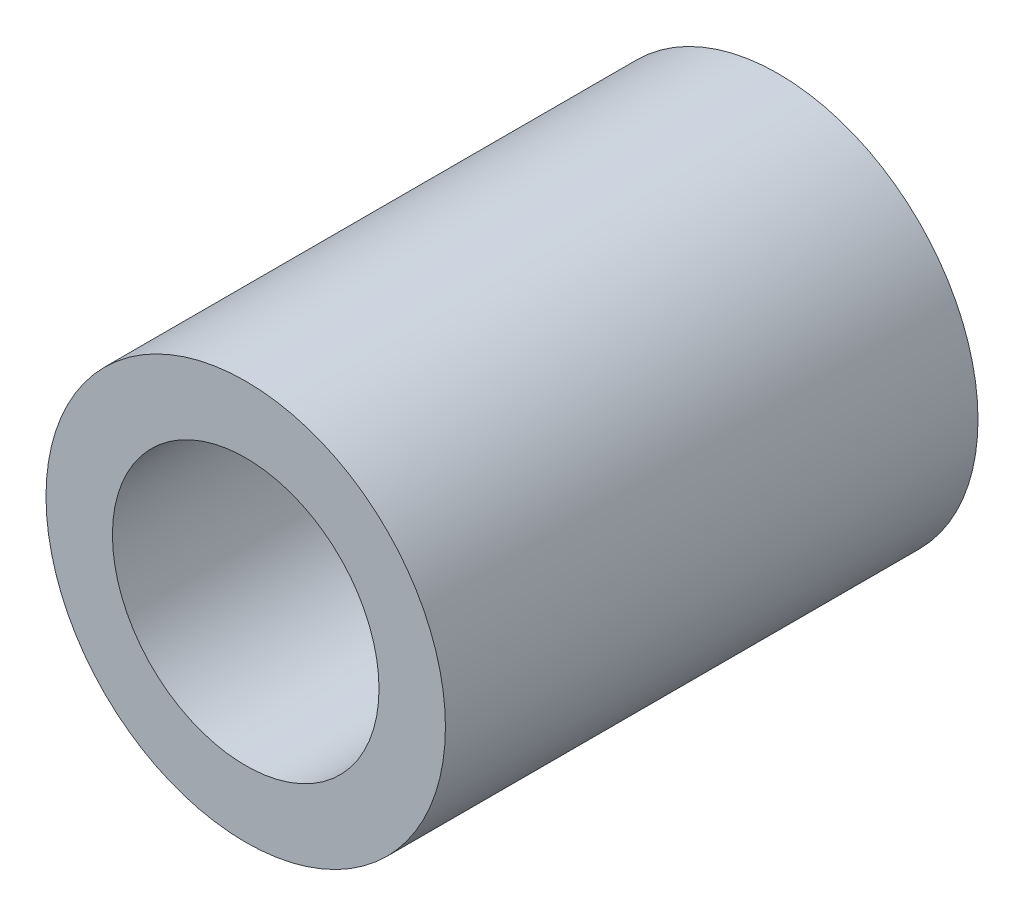
ISO-10303-21;
HEADER;
FILE_DESCRIPTION(('STEP AP214'),'2;1');
FILE_NAME('part.step','',(''),(''),'','','');
FILE_SCHEMA(('AUTOMOTIVE_DESIGN { 1 0 10303 214 1 1 1 1 }'));
ENDSEC;
DATA;
#1=APPLICATION_CONTEXT('core data for automotive mechanical design processes');
#2=APPLICATION_PROTOCOL_DEFINITION('international standard','automotive_design',2000,#1);
#3=PRODUCT_CONTEXT('',#1,'mechanical');
#4=PRODUCT('Part','Part','',(#3));
#5=PRODUCT_RELATED_PRODUCT_CATEGORY('part','',(#4));
#6=PRODUCT_DEFINITION_FORMATION('','',#4);
#7=PRODUCT_DEFINITION_CONTEXT('part definition',#1,'design');
#8=PRODUCT_DEFINITION('design','',#6,#7);
#9=PRODUCT_DEFINITION_SHAPE('','',#8);
#10=(LENGTH_UNIT() NAMED_UNIT(*) SI_UNIT(.MILLI.,.METRE.));
#11=(NAMED_UNIT(*) PLANE_ANGLE_UNIT() SI_UNIT($,.RADIAN.));
#12=(NAMED_UNIT(*) SI_UNIT($,.STERADIAN.) SOLID_ANGLE_UNIT());
#13=UNCERTAINTY_MEASURE_WITH_UNIT(LENGTH_MEASURE(1.E-05),#10,'distance_accuracy_value','');
#14=(GEOMETRIC_REPRESENTATION_CONTEXT(3) GLOBAL_UNCERTAINTY_ASSIGNED_CONTEXT((#13)) GLOBAL_UNIT_ASSIGNED_CONTEXT((#10,
#11,#12)) REPRESENTATION_CONTEXT('',''));
#15=CARTESIAN_POINT('',(0.,0.,0.));
#16=DIRECTION('',(0.,0.,1.));
#17=DIRECTION('',(1.,0.,0.));
#18=AXIS2_PLACEMENT_3D('',#15,#16,#17);
#19=CARTESIAN_POINT('',(0.,0.,-6.35));
#20=DIRECTION('',(0.,0.,1.));
#21=DIRECTION('',(1.,0.,0.));
#22=AXIS2_PLACEMENT_3D('',#19,#20,#21);
#23=CYLINDRICAL_SURFACE('',#22,4.7625);
#24=CARTESIAN_POINT('',(0.,0.,-6.35));
#25=DIRECTION('',(0.,0.,1.));
#26=DIRECTION('',(1.,0.,0.));
#27=AXIS2_PLACEMENT_3D('',#24,#25,#26);
#28=CIRCLE('',#27,4.7625);
#29=CARTESIAN_POINT('',(4.7625,0.,-6.35));
#30=VERTEX_POINT('',#29);
#31=EDGE_CURVE('E10',#30,#30,#28,.T.);
#32=ORIENTED_EDGE('',*,*,#31,.T.);
#33=EDGE_LOOP('',(#32));
#34=FACE_BOUND('',#33,.T.);
#35=CARTESIAN_POINT('',(0.,0.,6.35));
#36=DIRECTION('',(0.,0.,1.));
#37=DIRECTION('',(1.,0.,0.));
#38=AXIS2_PLACEMENT_3D('',#35,#36,#37);
#39=CIRCLE('',#38,4.7625);
#40=CARTESIAN_POINT('',(4.7625,0.,6.35));
#41=VERTEX_POINT('',#40);
#42=EDGE_CURVE('E61',#41,#41,#39,.T.);
#43=ORIENTED_EDGE('',*,*,#42,.F.);
#44=EDGE_LOOP('',(#43));
#45=FACE_BOUND('',#44,.T.);
#46=ADVANCED_FACE('F47',(#34,#45),#23,.T.);
#47=CARTESIAN_POINT('',(0.,0.,-6.35));
#48=DIRECTION('',(0.,0.,1.));
#49=DIRECTION('',(1.,0.,0.));
#50=AXIS2_PLACEMENT_3D('',#47,#48,#49);
#51=PLANE('',#50);
#52=CARTESIAN_POINT('',(0.,0.,-6.35));
#53=DIRECTION('',(0.,0.,1.));
#54=DIRECTION('',(1.,0.,0.));
#55=AXIS2_PLACEMENT_3D('',#52,#53,#54);
#56=CIRCLE('',#55,3.17881);
#57=CARTESIAN_POINT('',(3.17881,0.,-6.35));
#58=VERTEX_POINT('',#57);
#59=EDGE_CURVE('E54',#58,#58,#56,.T.);
#60=ORIENTED_EDGE('',*,*,#59,.T.);
#61=EDGE_LOOP('',(#60));
#62=FACE_BOUND('',#61,.T.);
#63=ORIENTED_EDGE('',*,*,#31,.F.);
#64=EDGE_LOOP('',(#63));
#65=FACE_BOUND('',#64,.T.);
#66=ADVANCED_FACE('F83',(#62,#65),#51,.F.);
#67=CARTESIAN_POINT('',(0.,0.,-6.35));
#68=DIRECTION('',(0.,0.,1.));
#69=DIRECTION('',(1.,0.,0.));
#70=AXIS2_PLACEMENT_3D('',#67,#68,#69);
#71=CYLINDRICAL_SURFACE('',#70,3.17881);
#72=ORIENTED_EDGE('',*,*,#59,.F.);
#73=EDGE_LOOP('',(#72));
#74=FACE_BOUND('',#73,.T.);
#75=CARTESIAN_POINT('',(0.,0.,6.35));
#76=DIRECTION('',(0.,0.,1.));
#77=DIRECTION('',(1.,0.,0.));
#78=AXIS2_PLACEMENT_3D('',#75,#76,#77);
#79=CIRCLE('',#78,3.17881);
#80=CARTESIAN_POINT('',(3.17881,0.,6.35));
#81=VERTEX_POINT('',#80);
#82=EDGE_CURVE('E67',#81,#81,#79,.T.);
#83=ORIENTED_EDGE('',*,*,#82,.T.);
#84=EDGE_LOOP('',(#83));
#85=FACE_BOUND('',#84,.T.);
#86=ADVANCED_FACE('F74',(#74,#85),#71,.F.);
#87=CARTESIAN_POINT('',(0.,0.,6.35));
#88=DIRECTION('',(0.,0.,1.));
#89=DIRECTION('',(1.,0.,0.));
#90=AXIS2_PLACEMENT_3D('',#87,#88,#89);
#91=PLANE('',#90);
#92=ORIENTED_EDGE('',*,*,#42,.T.);
#93=EDGE_LOOP('',(#92));
#94=FACE_BOUND('',#93,.T.);
#95=ORIENTED_EDGE('',*,*,#82,.F.);
#96=EDGE_LOOP('',(#95));
#97=FACE_BOUND('',#96,.T.);
#98=ADVANCED_FACE('F76',(#94,#97),#91,.T.);
#99=CLOSED_SHELL('',(#46,#66,#86,#98));
#100=MANIFOLD_SOLID_BREP('B2',#99);
#101=ADVANCED_BREP_SHAPE_REPRESENTATION('',(#18,#100),#14);
#102=SHAPE_DEFINITION_REPRESENTATION(#9,#101);
ENDSEC;
END-ISO-10303-21;
